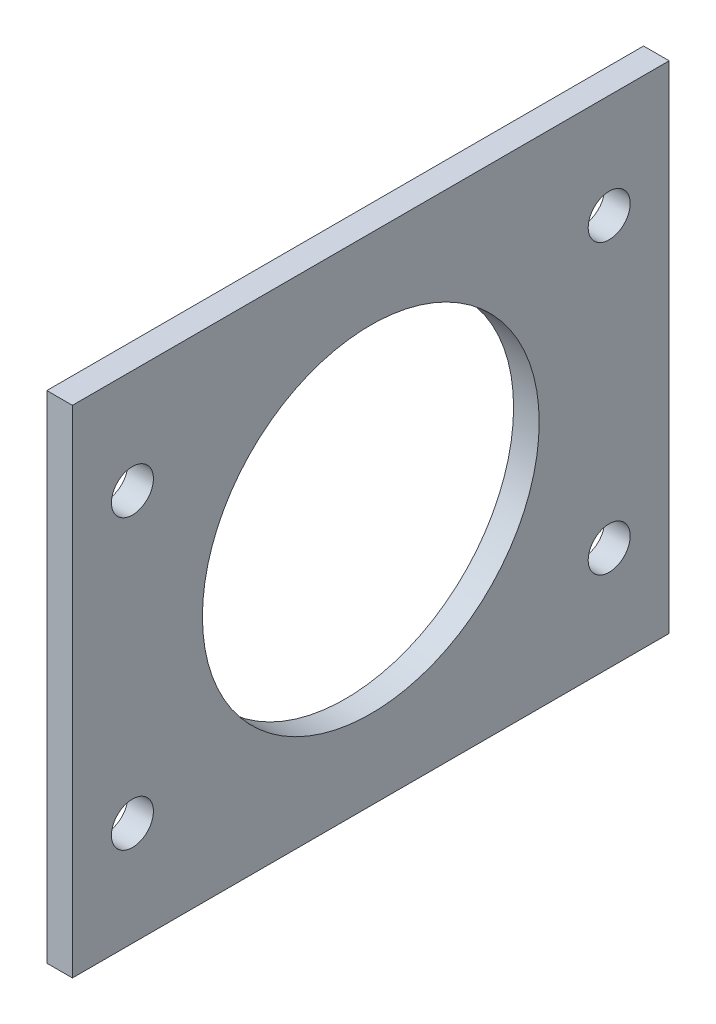
ISO-10303-21;
HEADER;
FILE_DESCRIPTION(('STEP AP214'),'2;1');
FILE_NAME('part.step','',(''),(''),'','','');
FILE_SCHEMA(('AUTOMOTIVE_DESIGN { 1 0 10303 214 1 1 1 1 }'));
ENDSEC;
DATA;
#1=APPLICATION_CONTEXT('core data for automotive mechanical design processes');
#2=APPLICATION_PROTOCOL_DEFINITION('international standard','automotive_design',2000,#1);
#3=PRODUCT_CONTEXT('',#1,'mechanical');
#4=PRODUCT('Part','Part','',(#3));
#5=PRODUCT_RELATED_PRODUCT_CATEGORY('part','',(#4));
#6=PRODUCT_DEFINITION_FORMATION('','',#4);
#7=PRODUCT_DEFINITION_CONTEXT('part definition',#1,'design');
#8=PRODUCT_DEFINITION('design','',#6,#7);
#9=PRODUCT_DEFINITION_SHAPE('','',#8);
#10=(LENGTH_UNIT() NAMED_UNIT(*) SI_UNIT(.MILLI.,.METRE.));
#11=(NAMED_UNIT(*) PLANE_ANGLE_UNIT() SI_UNIT($,.RADIAN.));
#12=(NAMED_UNIT(*) SI_UNIT($,.STERADIAN.) SOLID_ANGLE_UNIT());
#13=UNCERTAINTY_MEASURE_WITH_UNIT(LENGTH_MEASURE(1.E-05),#10,'distance_accuracy_value','');
#14=(GEOMETRIC_REPRESENTATION_CONTEXT(3) GLOBAL_UNCERTAINTY_ASSIGNED_CONTEXT((#13)) GLOBAL_UNIT_ASSIGNED_CONTEXT((#10,
#11,#12)) REPRESENTATION_CONTEXT('',''));
#15=CARTESIAN_POINT('',(0.,0.,0.));
#16=DIRECTION('',(0.,0.,1.));
#17=DIRECTION('',(1.,0.,0.));
#18=AXIS2_PLACEMENT_3D('',#15,#16,#17);
#19=CARTESIAN_POINT('',(3.2,0.,0.));
#20=DIRECTION('',(0.,0.,-1.));
#21=DIRECTION('',(-1.,0.,0.));
#22=AXIS2_PLACEMENT_3D('',#19,#20,#21);
#23=PLANE('',#22);
#24=DIRECTION('',(0.,-1.,0.));
#25=VECTOR('',#24,1.);
#26=CARTESIAN_POINT('',(0.,0.,0.));
#27=LINE('',#26,#25);
#28=CARTESIAN_POINT('',(0.,62.,0.));
#29=VERTEX_POINT('',#28);
#30=CARTESIAN_POINT('',(0.,0.,0.));
#31=VERTEX_POINT('',#30);
#32=EDGE_CURVE('E96',#29,#31,#27,.T.);
#33=ORIENTED_EDGE('',*,*,#32,.T.);
#34=DIRECTION('',(-1.,0.,0.));
#35=VECTOR('',#34,1.);
#36=CARTESIAN_POINT('',(3.2,0.,0.));
#37=LINE('',#36,#35);
#38=CARTESIAN_POINT('',(3.2,0.,0.));
#39=VERTEX_POINT('',#38);
#40=EDGE_CURVE('E11',#39,#31,#37,.T.);
#41=ORIENTED_EDGE('',*,*,#40,.F.);
#42=DIRECTION('',(0.,-1.,0.));
#43=VECTOR('',#42,1.);
#44=CARTESIAN_POINT('',(3.2,0.,0.));
#45=LINE('',#44,#43);
#46=CARTESIAN_POINT('',(3.2,62.,0.));
#47=VERTEX_POINT('',#46);
#48=EDGE_CURVE('E84',#47,#39,#45,.T.);
#49=ORIENTED_EDGE('',*,*,#48,.F.);
#50=DIRECTION('',(-1.,0.,0.));
#51=VECTOR('',#50,1.);
#52=CARTESIAN_POINT('',(3.2,62.,0.));
#53=LINE('',#52,#51);
#54=EDGE_CURVE('E92',#47,#29,#53,.T.);
#55=ORIENTED_EDGE('',*,*,#54,.T.);
#56=EDGE_LOOP('',(#33,#41,#49,#55));
#57=FACE_BOUND('',#56,.T.);
#58=ADVANCED_FACE('F33',(#57),#23,.F.);
#59=CARTESIAN_POINT('',(3.2,0.,0.));
#60=DIRECTION('',(0.,1.,0.));
#61=DIRECTION('',(0.,0.,1.));
#62=AXIS2_PLACEMENT_3D('',#59,#60,#61);
#63=PLANE('',#62);
#64=DIRECTION('',(0.,0.,-1.));
#65=VECTOR('',#64,1.);
#66=CARTESIAN_POINT('',(0.,0.,0.));
#67=LINE('',#66,#65);
#68=CARTESIAN_POINT('',(0.,0.,-74.6));
#69=VERTEX_POINT('',#68);
#70=EDGE_CURVE('E88',#31,#69,#67,.T.);
#71=ORIENTED_EDGE('',*,*,#70,.T.);
#72=DIRECTION('',(-1.,0.,0.));
#73=VECTOR('',#72,1.);
#74=CARTESIAN_POINT('',(3.2,0.,-74.6));
#75=LINE('',#74,#73);
#76=CARTESIAN_POINT('',(3.2,0.,-74.6));
#77=VERTEX_POINT('',#76);
#78=EDGE_CURVE('E41',#77,#69,#75,.T.);
#79=ORIENTED_EDGE('',*,*,#78,.F.);
#80=DIRECTION('',(0.,0.,-1.));
#81=VECTOR('',#80,1.);
#82=CARTESIAN_POINT('',(3.2,0.,0.));
#83=LINE('',#82,#81);
#84=EDGE_CURVE('E79',#39,#77,#83,.T.);
#85=ORIENTED_EDGE('',*,*,#84,.F.);
#86=ORIENTED_EDGE('',*,*,#40,.T.);
#87=EDGE_LOOP('',(#71,#79,#85,#86));
#88=FACE_BOUND('',#87,.T.);
#89=ADVANCED_FACE('F87',(#88),#63,.F.);
#90=CARTESIAN_POINT('',(3.2,0.,-74.6));
#91=DIRECTION('',(0.,0.,1.));
#92=DIRECTION('',(1.,0.,0.));
#93=AXIS2_PLACEMENT_3D('',#90,#91,#92);
#94=PLANE('',#93);
#95=DIRECTION('',(0.,1.,0.));
#96=VECTOR('',#95,1.);
#97=CARTESIAN_POINT('',(0.,0.,-74.6));
#98=LINE('',#97,#96);
#99=CARTESIAN_POINT('',(0.,62.,-74.6));
#100=VERTEX_POINT('',#99);
#101=EDGE_CURVE('E66',#69,#100,#98,.T.);
#102=ORIENTED_EDGE('',*,*,#101,.T.);
#103=DIRECTION('',(-1.,0.,0.));
#104=VECTOR('',#103,1.);
#105=CARTESIAN_POINT('',(3.2,62.,-74.6));
#106=LINE('',#105,#104);
#107=CARTESIAN_POINT('',(3.2,62.,-74.6));
#108=VERTEX_POINT('',#107);
#109=EDGE_CURVE('E89',#108,#100,#106,.T.);
#110=ORIENTED_EDGE('',*,*,#109,.F.);
#111=DIRECTION('',(0.,1.,0.));
#112=VECTOR('',#111,1.);
#113=CARTESIAN_POINT('',(3.2,0.,-74.6));
#114=LINE('',#113,#112);
#115=EDGE_CURVE('E82',#77,#108,#114,.T.);
#116=ORIENTED_EDGE('',*,*,#115,.F.);
#117=ORIENTED_EDGE('',*,*,#78,.T.);
#118=EDGE_LOOP('',(#102,#110,#116,#117));
#119=FACE_BOUND('',#118,.T.);
#120=ADVANCED_FACE('F90',(#119),#94,.F.);
#121=CARTESIAN_POINT('',(3.2,62.,0.));
#122=DIRECTION('',(0.,-1.,0.));
#123=DIRECTION('',(0.,0.,-1.));
#124=AXIS2_PLACEMENT_3D('',#121,#122,#123);
#125=PLANE('',#124);
#126=DIRECTION('',(0.,0.,1.));
#127=VECTOR('',#126,1.);
#128=CARTESIAN_POINT('',(0.,62.,0.));
#129=LINE('',#128,#127);
#130=EDGE_CURVE('E72',#100,#29,#129,.T.);
#131=ORIENTED_EDGE('',*,*,#130,.T.);
#132=ORIENTED_EDGE('',*,*,#54,.F.);
#133=DIRECTION('',(0.,0.,1.));
#134=VECTOR('',#133,1.);
#135=CARTESIAN_POINT('',(3.2,62.,0.));
#136=LINE('',#135,#134);
#137=EDGE_CURVE('E49',#108,#47,#136,.T.);
#138=ORIENTED_EDGE('',*,*,#137,.F.);
#139=ORIENTED_EDGE('',*,*,#109,.T.);
#140=EDGE_LOOP('',(#131,#132,#138,#139));
#141=FACE_BOUND('',#140,.T.);
#142=ADVANCED_FACE('F104',(#141),#125,.F.);
#143=CARTESIAN_POINT('',(3.2,0.,0.));
#144=DIRECTION('',(-1.,0.,0.));
#145=DIRECTION('',(0.,0.,1.));
#146=AXIS2_PLACEMENT_3D('',#143,#144,#145);
#147=PLANE('',#146);
#148=CARTESIAN_POINT('',(3.2,49.,-7.50000000000008));
#149=DIRECTION('',(-1.,0.,0.));
#150=DIRECTION('',(0.,0.,1.));
#151=AXIS2_PLACEMENT_3D('',#148,#149,#150);
#152=CIRCLE('',#151,2.625);
#153=CARTESIAN_POINT('',(3.2,49.,-4.87500000000008));
#154=VERTEX_POINT('',#153);
#155=EDGE_CURVE('E133',#154,#154,#152,.F.);
#156=ORIENTED_EDGE('',*,*,#155,.F.);
#157=EDGE_LOOP('',(#156));
#158=FACE_BOUND('',#157,.T.);
#159=CARTESIAN_POINT('',(3.2,13.,-7.50000000000007));
#160=DIRECTION('',(-1.,0.,0.));
#161=DIRECTION('',(0.,0.,1.));
#162=AXIS2_PLACEMENT_3D('',#159,#160,#161);
#163=CIRCLE('',#162,2.625);
#164=CARTESIAN_POINT('',(3.2,13.,-4.87500000000007));
#165=VERTEX_POINT('',#164);
#166=EDGE_CURVE('E127',#165,#165,#163,.F.);
#167=ORIENTED_EDGE('',*,*,#166,.F.);
#168=EDGE_LOOP('',(#167));
#169=FACE_BOUND('',#168,.T.);
#170=CARTESIAN_POINT('',(3.2,48.9999999999999,-67.1000000000001));
#171=DIRECTION('',(-1.,0.,0.));
#172=DIRECTION('',(0.,0.,1.));
#173=AXIS2_PLACEMENT_3D('',#170,#171,#172);
#174=CIRCLE('',#173,2.62499999999999);
#175=CARTESIAN_POINT('',(3.2,48.9999999999999,-64.4750000000001));
#176=VERTEX_POINT('',#175);
#177=EDGE_CURVE('E121',#176,#176,#174,.F.);
#178=ORIENTED_EDGE('',*,*,#177,.F.);
#179=EDGE_LOOP('',(#178));
#180=FACE_BOUND('',#179,.T.);
#181=CARTESIAN_POINT('',(3.2,12.9999999999999,-67.1000000000001));
#182=DIRECTION('',(-1.,0.,0.));
#183=DIRECTION('',(0.,0.,1.));
#184=AXIS2_PLACEMENT_3D('',#181,#182,#183);
#185=CIRCLE('',#184,2.625);
#186=CARTESIAN_POINT('',(3.2,12.9999999999999,-64.4750000000001));
#187=VERTEX_POINT('',#186);
#188=EDGE_CURVE('E113',#187,#187,#185,.F.);
#189=ORIENTED_EDGE('',*,*,#188,.F.);
#190=EDGE_LOOP('',(#189));
#191=FACE_BOUND('',#190,.T.);
#192=CARTESIAN_POINT('',(3.2,31.,-37.3));
#193=DIRECTION('',(1.,0.,0.));
#194=DIRECTION('',(0.,0.,1.));
#195=AXIS2_PLACEMENT_3D('',#192,#193,#194);
#196=CIRCLE('',#195,21.05);
#197=CARTESIAN_POINT('',(3.2,31.,-16.25));
#198=VERTEX_POINT('',#197);
#199=EDGE_CURVE('E99',#198,#198,#196,.T.);
#200=ORIENTED_EDGE('',*,*,#199,.F.);
#201=EDGE_LOOP('',(#200));
#202=FACE_BOUND('',#201,.T.);
#203=ORIENTED_EDGE('',*,*,#48,.T.);
#204=ORIENTED_EDGE('',*,*,#84,.T.);
#205=ORIENTED_EDGE('',*,*,#115,.T.);
#206=ORIENTED_EDGE('',*,*,#137,.T.);
#207=EDGE_LOOP('',(#203,#204,#205,#206));
#208=FACE_BOUND('',#207,.T.);
#209=ADVANCED_FACE('F80',(#158,#169,#180,#191,#202,#208),#147,.F.);
#210=CARTESIAN_POINT('',(0.,0.,0.));
#211=DIRECTION('',(-1.,0.,0.));
#212=DIRECTION('',(0.,0.,1.));
#213=AXIS2_PLACEMENT_3D('',#210,#211,#212);
#214=PLANE('',#213);
#215=CARTESIAN_POINT('',(0.,49.,-7.50000000000008));
#216=DIRECTION('',(-1.,0.,0.));
#217=DIRECTION('',(0.,0.,1.));
#218=AXIS2_PLACEMENT_3D('',#215,#216,#217);
#219=CIRCLE('',#218,2.625);
#220=CARTESIAN_POINT('',(0.,49.,-4.87500000000008));
#221=VERTEX_POINT('',#220);
#222=EDGE_CURVE('E136',#221,#221,#219,.T.);
#223=ORIENTED_EDGE('',*,*,#222,.F.);
#224=EDGE_LOOP('',(#223));
#225=FACE_BOUND('',#224,.T.);
#226=CARTESIAN_POINT('',(0.,13.,-7.50000000000007));
#227=DIRECTION('',(-1.,0.,0.));
#228=DIRECTION('',(0.,0.,1.));
#229=AXIS2_PLACEMENT_3D('',#226,#227,#228);
#230=CIRCLE('',#229,2.625);
#231=CARTESIAN_POINT('',(0.,13.,-4.87500000000007));
#232=VERTEX_POINT('',#231);
#233=EDGE_CURVE('E130',#232,#232,#230,.T.);
#234=ORIENTED_EDGE('',*,*,#233,.F.);
#235=EDGE_LOOP('',(#234));
#236=FACE_BOUND('',#235,.T.);
#237=CARTESIAN_POINT('',(0.,48.9999999999999,-67.1000000000001));
#238=DIRECTION('',(-1.,0.,0.));
#239=DIRECTION('',(0.,0.,1.));
#240=AXIS2_PLACEMENT_3D('',#237,#238,#239);
#241=CIRCLE('',#240,2.62499999999999);
#242=CARTESIAN_POINT('',(0.,48.9999999999999,-64.4750000000001));
#243=VERTEX_POINT('',#242);
#244=EDGE_CURVE('E124',#243,#243,#241,.T.);
#245=ORIENTED_EDGE('',*,*,#244,.F.);
#246=EDGE_LOOP('',(#245));
#247=FACE_BOUND('',#246,.T.);
#248=CARTESIAN_POINT('',(0.,12.9999999999999,-67.1000000000001));
#249=DIRECTION('',(-1.,0.,0.));
#250=DIRECTION('',(0.,0.,1.));
#251=AXIS2_PLACEMENT_3D('',#248,#249,#250);
#252=CIRCLE('',#251,2.625);
#253=CARTESIAN_POINT('',(0.,12.9999999999999,-64.4750000000001));
#254=VERTEX_POINT('',#253);
#255=EDGE_CURVE('E118',#254,#254,#252,.T.);
#256=ORIENTED_EDGE('',*,*,#255,.F.);
#257=EDGE_LOOP('',(#256));
#258=FACE_BOUND('',#257,.T.);
#259=CARTESIAN_POINT('',(0.,31.,-37.3));
#260=DIRECTION('',(-1.,0.,0.));
#261=DIRECTION('',(0.,0.,1.));
#262=AXIS2_PLACEMENT_3D('',#259,#260,#261);
#263=CIRCLE('',#262,21.05);
#264=CARTESIAN_POINT('',(0.,31.,-16.25));
#265=VERTEX_POINT('',#264);
#266=EDGE_CURVE('E110',#265,#265,#263,.F.);
#267=ORIENTED_EDGE('',*,*,#266,.T.);
#268=EDGE_LOOP('',(#267));
#269=FACE_BOUND('',#268,.T.);
#270=ORIENTED_EDGE('',*,*,#32,.F.);
#271=ORIENTED_EDGE('',*,*,#130,.F.);
#272=ORIENTED_EDGE('',*,*,#101,.F.);
#273=ORIENTED_EDGE('',*,*,#70,.F.);
#274=EDGE_LOOP('',(#270,#271,#272,#273));
#275=FACE_BOUND('',#274,.T.);
#276=ADVANCED_FACE('F107',(#225,#236,#247,#258,#269,#275),#214,.T.);
#277=CARTESIAN_POINT('',(-0.00100000000000013,31.,-37.3));
#278=DIRECTION('',(1.,0.,0.));
#279=DIRECTION('',(0.,0.,-1.));
#280=AXIS2_PLACEMENT_3D('',#277,#278,#279);
#281=CYLINDRICAL_SURFACE('',#280,21.05);
#282=ORIENTED_EDGE('',*,*,#266,.F.);
#283=EDGE_LOOP('',(#282));
#284=FACE_BOUND('',#283,.T.);
#285=ORIENTED_EDGE('',*,*,#199,.T.);
#286=EDGE_LOOP('',(#285));
#287=FACE_BOUND('',#286,.T.);
#288=ADVANCED_FACE('F145',(#284,#287),#281,.F.);
#289=CARTESIAN_POINT('',(3.201,12.9999999999999,-67.1000000000001));
#290=DIRECTION('',(-1.,0.,0.));
#291=DIRECTION('',(0.,0.,1.));
#292=AXIS2_PLACEMENT_3D('',#289,#290,#291);
#293=CYLINDRICAL_SURFACE('',#292,2.625);
#294=ORIENTED_EDGE('',*,*,#255,.T.);
#295=EDGE_LOOP('',(#294));
#296=FACE_BOUND('',#295,.T.);
#297=ORIENTED_EDGE('',*,*,#188,.T.);
#298=EDGE_LOOP('',(#297));
#299=FACE_BOUND('',#298,.T.);
#300=ADVANCED_FACE('F157',(#296,#299),#293,.F.);
#301=CARTESIAN_POINT('',(3.201,48.9999999999999,-67.1000000000001));
#302=DIRECTION('',(-1.,0.,0.));
#303=DIRECTION('',(0.,0.,1.));
#304=AXIS2_PLACEMENT_3D('',#301,#302,#303);
#305=CYLINDRICAL_SURFACE('',#304,2.62499999999999);
#306=ORIENTED_EDGE('',*,*,#244,.T.);
#307=EDGE_LOOP('',(#306));
#308=FACE_BOUND('',#307,.T.);
#309=ORIENTED_EDGE('',*,*,#177,.T.);
#310=EDGE_LOOP('',(#309));
#311=FACE_BOUND('',#310,.T.);
#312=ADVANCED_FACE('F204',(#308,#311),#305,.F.);
#313=CARTESIAN_POINT('',(3.201,13.,-7.50000000000007));
#314=DIRECTION('',(-1.,0.,0.));
#315=DIRECTION('',(0.,0.,1.));
#316=AXIS2_PLACEMENT_3D('',#313,#314,#315);
#317=CYLINDRICAL_SURFACE('',#316,2.625);
#318=ORIENTED_EDGE('',*,*,#233,.T.);
#319=EDGE_LOOP('',(#318));
#320=FACE_BOUND('',#319,.T.);
#321=ORIENTED_EDGE('',*,*,#166,.T.);
#322=EDGE_LOOP('',(#321));
#323=FACE_BOUND('',#322,.T.);
#324=ADVANCED_FACE('F212',(#320,#323),#317,.F.);
#325=CARTESIAN_POINT('',(3.201,49.,-7.50000000000008));
#326=DIRECTION('',(-1.,0.,0.));
#327=DIRECTION('',(0.,0.,1.));
#328=AXIS2_PLACEMENT_3D('',#325,#326,#327);
#329=CYLINDRICAL_SURFACE('',#328,2.625);
#330=ORIENTED_EDGE('',*,*,#222,.T.);
#331=EDGE_LOOP('',(#330));
#332=FACE_BOUND('',#331,.T.);
#333=ORIENTED_EDGE('',*,*,#155,.T.);
#334=EDGE_LOOP('',(#333));
#335=FACE_BOUND('',#334,.T.);
#336=ADVANCED_FACE('F140',(#332,#335),#329,.F.);
#337=CLOSED_SHELL('',(#58,#89,#120,#142,#209,#276,#288,#300,#312,#324,#336));
#338=MANIFOLD_SOLID_BREP('B2',#337);
#339=ADVANCED_BREP_SHAPE_REPRESENTATION('',(#18,#338),#14);
#340=SHAPE_DEFINITION_REPRESENTATION(#9,#339);
ENDSEC;
END-ISO-10303-21;
